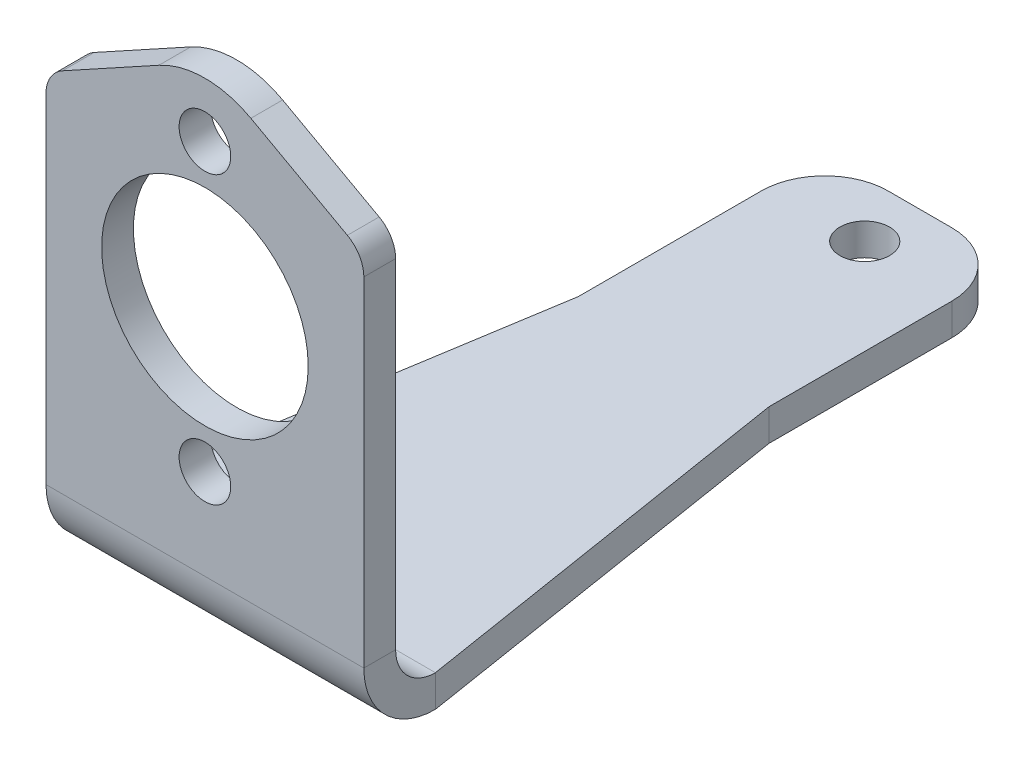
ISO-10303-21;
HEADER;
FILE_DESCRIPTION(('STEP AP214'),'2;1');
FILE_NAME('part.step','',(''),(''),'','','');
FILE_SCHEMA(('AUTOMOTIVE_DESIGN { 1 0 10303 214 1 1 1 1 }'));
ENDSEC;
DATA;
#1=APPLICATION_CONTEXT('core data for automotive mechanical design processes');
#2=APPLICATION_PROTOCOL_DEFINITION('international standard','automotive_design',2000,#1);
#3=PRODUCT_CONTEXT('',#1,'mechanical');
#4=PRODUCT('Part','Part','',(#3));
#5=PRODUCT_RELATED_PRODUCT_CATEGORY('part','',(#4));
#6=PRODUCT_DEFINITION_FORMATION('','',#4);
#7=PRODUCT_DEFINITION_CONTEXT('part definition',#1,'design');
#8=PRODUCT_DEFINITION('design','',#6,#7);
#9=PRODUCT_DEFINITION_SHAPE('','',#8);
#10=(LENGTH_UNIT() NAMED_UNIT(*) SI_UNIT(.MILLI.,.METRE.));
#11=(NAMED_UNIT(*) PLANE_ANGLE_UNIT() SI_UNIT($,.RADIAN.));
#12=(NAMED_UNIT(*) SI_UNIT($,.STERADIAN.) SOLID_ANGLE_UNIT());
#13=UNCERTAINTY_MEASURE_WITH_UNIT(LENGTH_MEASURE(1.E-05),#10,'distance_accuracy_value','');
#14=(GEOMETRIC_REPRESENTATION_CONTEXT(3) GLOBAL_UNCERTAINTY_ASSIGNED_CONTEXT((#13)) GLOBAL_UNIT_ASSIGNED_CONTEXT((#10,
#11,#12)) REPRESENTATION_CONTEXT('',''));
#15=CARTESIAN_POINT('',(0.,0.,0.));
#16=DIRECTION('',(0.,0.,1.));
#17=DIRECTION('',(1.,0.,0.));
#18=AXIS2_PLACEMENT_3D('',#15,#16,#17);
#19=CARTESIAN_POINT('',(0.,0.,-6.35));
#20=DIRECTION('',(-1.,0.,0.));
#21=DIRECTION('',(0.,0.,1.));
#22=AXIS2_PLACEMENT_3D('',#19,#20,#21);
#23=PLANE('',#22);
#24=DIRECTION('',(0.,-1.,0.));
#25=VECTOR('',#24,1.);
#26=CARTESIAN_POINT('',(0.,0.,0.));
#27=LINE('',#26,#25);
#28=CARTESIAN_POINT('',(0.,81.970427746324,0.));
#29=VERTEX_POINT('',#28);
#30=CARTESIAN_POINT('',(0.,14.3002,0.));
#31=VERTEX_POINT('',#30);
#32=EDGE_CURVE('E265',#29,#31,#27,.T.);
#33=ORIENTED_EDGE('',*,*,#32,.F.);
#34=DIRECTION('',(0.,0.,1.));
#35=VECTOR('',#34,1.);
#36=CARTESIAN_POINT('',(0.,81.970427746324,-6.35));
#37=LINE('',#36,#35);
#38=CARTESIAN_POINT('',(0.,81.970427746324,-6.35));
#39=VERTEX_POINT('',#38);
#40=EDGE_CURVE('E316',#29,#39,#37,.F.);
#41=ORIENTED_EDGE('',*,*,#40,.T.);
#42=DIRECTION('',(0.,-1.,0.));
#43=VECTOR('',#42,1.);
#44=CARTESIAN_POINT('',(0.,0.,-6.35));
#45=LINE('',#44,#43);
#46=CARTESIAN_POINT('',(0.,14.3002,-6.35));
#47=VERTEX_POINT('',#46);
#48=EDGE_CURVE('E268',#39,#47,#45,.T.);
#49=ORIENTED_EDGE('',*,*,#48,.T.);
#50=DIRECTION('',(0.,0.,1.));
#51=VECTOR('',#50,1.);
#52=CARTESIAN_POINT('',(0.,14.3002,-6.35));
#53=LINE('',#52,#51);
#54=EDGE_CURVE('E360',#47,#31,#53,.T.);
#55=ORIENTED_EDGE('',*,*,#54,.T.);
#56=EDGE_LOOP('',(#33,#41,#49,#55));
#57=FACE_BOUND('',#56,.T.);
#58=ADVANCED_FACE('F66',(#57),#23,.T.);
#59=CARTESIAN_POINT('',(0.,0.,-6.35));
#60=DIRECTION('',(0.,0.,-1.));
#61=DIRECTION('',(-1.,0.,0.));
#62=AXIS2_PLACEMENT_3D('',#59,#60,#61);
#63=PLANE('',#62);
#64=CARTESIAN_POINT('',(31.75,32.385,-6.35));
#65=DIRECTION('',(0.,0.,1.));
#66=DIRECTION('',(1.,0.,0.));
#67=AXIS2_PLACEMENT_3D('',#64,#65,#66);
#68=CIRCLE('',#67,5.159375);
#69=CARTESIAN_POINT('',(36.909375,32.385,-6.35));
#70=VERTEX_POINT('',#69);
#71=EDGE_CURVE('E261',#70,#70,#68,.T.);
#72=ORIENTED_EDGE('',*,*,#71,.T.);
#73=EDGE_LOOP('',(#72));
#74=FACE_BOUND('',#73,.T.);
#75=CARTESIAN_POINT('',(31.75,89.535,-6.35));
#76=DIRECTION('',(0.,0.,1.));
#77=DIRECTION('',(1.,0.,0.));
#78=AXIS2_PLACEMENT_3D('',#75,#76,#77);
#79=CIRCLE('',#78,5.159375);
#80=CARTESIAN_POINT('',(36.909375,89.535,-6.35));
#81=VERTEX_POINT('',#80);
#82=EDGE_CURVE('E247',#81,#81,#79,.T.);
#83=ORIENTED_EDGE('',*,*,#82,.T.);
#84=EDGE_LOOP('',(#83));
#85=FACE_BOUND('',#84,.T.);
#86=CARTESIAN_POINT('',(31.75,60.96,-6.35));
#87=DIRECTION('',(0.,0.,1.));
#88=DIRECTION('',(1.,0.,0.));
#89=AXIS2_PLACEMENT_3D('',#86,#87,#88);
#90=CIRCLE('',#89,20.6375);
#91=CARTESIAN_POINT('',(52.3875,60.96,-6.35));
#92=VERTEX_POINT('',#91);
#93=EDGE_CURVE('E262',#92,#92,#90,.T.);
#94=ORIENTED_EDGE('',*,*,#93,.T.);
#95=EDGE_LOOP('',(#94));
#96=FACE_BOUND('',#95,.T.);
#97=DIRECTION('',(-0.876215908676647,0.481918749772156,0.));
#98=VECTOR('',#97,1.);
#99=CARTESIAN_POINT('',(31.75,103.1875,-6.35));
#100=LINE('',#99,#98);
#101=CARTESIAN_POINT('',(60.2101840610532,87.5343987664208,-6.35));
#102=VERTEX_POINT('',#101);
#103=CARTESIAN_POINT('',(40.9305521831596,98.1381962992622,-6.35));
#104=VERTEX_POINT('',#103);
#105=EDGE_CURVE('E274',#102,#104,#100,.T.);
#106=ORIENTED_EDGE('',*,*,#105,.F.);
#107=CARTESIAN_POINT('',(57.15,81.970427746324,-6.35));
#108=DIRECTION('',(0.,0.,-1.));
#109=DIRECTION('',(-1.,0.,0.));
#110=AXIS2_PLACEMENT_3D('',#107,#108,#109);
#111=CIRCLE('',#110,6.35);
#112=CARTESIAN_POINT('',(63.5,81.970427746324,-6.35));
#113=VERTEX_POINT('',#112);
#114=EDGE_CURVE('E311',#102,#113,#111,.T.);
#115=ORIENTED_EDGE('',*,*,#114,.T.);
#116=DIRECTION('',(0.,1.,0.));
#117=VECTOR('',#116,1.);
#118=CARTESIAN_POINT('',(63.5,0.,-6.35));
#119=LINE('',#118,#117);
#120=CARTESIAN_POINT('',(63.5,14.3002,-6.35));
#121=VERTEX_POINT('',#120);
#122=EDGE_CURVE('E270',#121,#113,#119,.T.);
#123=ORIENTED_EDGE('',*,*,#122,.F.);
#124=DIRECTION('',(-1.,0.,0.));
#125=VECTOR('',#124,1.);
#126=CARTESIAN_POINT('',(0.,14.3002,-6.35));
#127=LINE('',#126,#125);
#128=EDGE_CURVE('E366',#47,#121,#127,.F.);
#129=ORIENTED_EDGE('',*,*,#128,.F.);
#130=ORIENTED_EDGE('',*,*,#48,.F.);
#131=CARTESIAN_POINT('',(6.35,81.970427746324,-6.35));
#132=DIRECTION('',(0.,0.,-1.));
#133=DIRECTION('',(-1.,0.,0.));
#134=AXIS2_PLACEMENT_3D('',#131,#132,#133);
#135=CIRCLE('',#134,6.35);
#136=CARTESIAN_POINT('',(3.28981593894681,87.5343987664208,-6.35));
#137=VERTEX_POINT('',#136);
#138=EDGE_CURVE('E309',#39,#137,#135,.T.);
#139=ORIENTED_EDGE('',*,*,#138,.T.);
#140=DIRECTION('',(-0.876215908676647,-0.481918749772156,0.));
#141=VECTOR('',#140,1.);
#142=CARTESIAN_POINT('',(0.,85.725,-6.35));
#143=LINE('',#142,#141);
#144=CARTESIAN_POINT('',(22.5694478168404,98.1381962992622,-6.35));
#145=VERTEX_POINT('',#144);
#146=EDGE_CURVE('E275',#145,#137,#143,.T.);
#147=ORIENTED_EDGE('',*,*,#146,.F.);
#148=CARTESIAN_POINT('',(31.75,81.4462832389721,-6.35));
#149=DIRECTION('',(0.,0.,-1.));
#150=DIRECTION('',(-1.,0.,0.));
#151=AXIS2_PLACEMENT_3D('',#148,#149,#150);
#152=CIRCLE('',#151,19.05);
#153=EDGE_CURVE('E297',#145,#104,#152,.T.);
#154=ORIENTED_EDGE('',*,*,#153,.T.);
#155=EDGE_LOOP('',(#106,#115,#123,#129,#130,#139,#147,#154));
#156=FACE_BOUND('',#155,.T.);
#157=ADVANCED_FACE('F389',(#74,#85,#96,#156),#63,.T.);
#158=CARTESIAN_POINT('',(0.,0.,0.));
#159=DIRECTION('',(0.,0.,-1.));
#160=DIRECTION('',(-1.,0.,0.));
#161=AXIS2_PLACEMENT_3D('',#158,#159,#160);
#162=PLANE('',#161);
#163=CARTESIAN_POINT('',(31.75,60.96,0.));
#164=DIRECTION('',(0.,0.,1.));
#165=DIRECTION('',(1.,0.,0.));
#166=AXIS2_PLACEMENT_3D('',#163,#164,#165);
#167=CIRCLE('',#166,20.6375);
#168=CARTESIAN_POINT('',(52.3875,60.96,0.));
#169=VERTEX_POINT('',#168);
#170=EDGE_CURVE('E252',#169,#169,#167,.T.);
#171=ORIENTED_EDGE('',*,*,#170,.F.);
#172=EDGE_LOOP('',(#171));
#173=FACE_BOUND('',#172,.T.);
#174=CARTESIAN_POINT('',(31.75,89.535,0.));
#175=DIRECTION('',(0.,0.,1.));
#176=DIRECTION('',(1.,0.,0.));
#177=AXIS2_PLACEMENT_3D('',#174,#175,#176);
#178=CIRCLE('',#177,5.159375);
#179=CARTESIAN_POINT('',(36.909375,89.535,0.));
#180=VERTEX_POINT('',#179);
#181=EDGE_CURVE('E253',#180,#180,#178,.T.);
#182=ORIENTED_EDGE('',*,*,#181,.F.);
#183=EDGE_LOOP('',(#182));
#184=FACE_BOUND('',#183,.T.);
#185=CARTESIAN_POINT('',(31.75,32.385,0.));
#186=DIRECTION('',(0.,0.,1.));
#187=DIRECTION('',(1.,0.,0.));
#188=AXIS2_PLACEMENT_3D('',#185,#186,#187);
#189=CIRCLE('',#188,5.159375);
#190=CARTESIAN_POINT('',(36.909375,32.385,0.));
#191=VERTEX_POINT('',#190);
#192=EDGE_CURVE('E254',#191,#191,#189,.T.);
#193=ORIENTED_EDGE('',*,*,#192,.F.);
#194=EDGE_LOOP('',(#193));
#195=FACE_BOUND('',#194,.T.);
#196=DIRECTION('',(0.,1.,0.));
#197=VECTOR('',#196,1.);
#198=CARTESIAN_POINT('',(63.5,0.,0.));
#199=LINE('',#198,#197);
#200=CARTESIAN_POINT('',(63.5,14.3002,0.));
#201=VERTEX_POINT('',#200);
#202=CARTESIAN_POINT('',(63.5,81.970427746324,0.));
#203=VERTEX_POINT('',#202);
#204=EDGE_CURVE('E281',#201,#203,#199,.T.);
#205=ORIENTED_EDGE('',*,*,#204,.T.);
#206=CARTESIAN_POINT('',(57.15,81.970427746324,0.));
#207=DIRECTION('',(0.,0.,-1.));
#208=DIRECTION('',(-1.,0.,0.));
#209=AXIS2_PLACEMENT_3D('',#206,#207,#208);
#210=CIRCLE('',#209,6.35);
#211=CARTESIAN_POINT('',(60.2101840610532,87.5343987664208,0.));
#212=VERTEX_POINT('',#211);
#213=EDGE_CURVE('E305',#203,#212,#210,.F.);
#214=ORIENTED_EDGE('',*,*,#213,.T.);
#215=DIRECTION('',(-0.876215908676647,0.481918749772156,0.));
#216=VECTOR('',#215,1.);
#217=CARTESIAN_POINT('',(31.75,103.1875,0.));
#218=LINE('',#217,#216);
#219=CARTESIAN_POINT('',(40.9305521831596,98.1381962992622,0.));
#220=VERTEX_POINT('',#219);
#221=EDGE_CURVE('E284',#212,#220,#218,.T.);
#222=ORIENTED_EDGE('',*,*,#221,.T.);
#223=CARTESIAN_POINT('',(31.75,81.4462832389721,0.));
#224=DIRECTION('',(0.,0.,-1.));
#225=DIRECTION('',(-1.,0.,0.));
#226=AXIS2_PLACEMENT_3D('',#223,#224,#225);
#227=CIRCLE('',#226,19.05);
#228=CARTESIAN_POINT('',(22.5694478168404,98.1381962992622,0.));
#229=VERTEX_POINT('',#228);
#230=EDGE_CURVE('E293',#220,#229,#227,.F.);
#231=ORIENTED_EDGE('',*,*,#230,.T.);
#232=DIRECTION('',(-0.876215908676647,-0.481918749772156,0.));
#233=VECTOR('',#232,1.);
#234=CARTESIAN_POINT('',(0.,85.725,0.));
#235=LINE('',#234,#233);
#236=CARTESIAN_POINT('',(3.28981593894681,87.5343987664208,0.));
#237=VERTEX_POINT('',#236);
#238=EDGE_CURVE('E271',#229,#237,#235,.T.);
#239=ORIENTED_EDGE('',*,*,#238,.T.);
#240=CARTESIAN_POINT('',(6.35,81.970427746324,0.));
#241=DIRECTION('',(0.,0.,-1.));
#242=DIRECTION('',(-1.,0.,0.));
#243=AXIS2_PLACEMENT_3D('',#240,#241,#242);
#244=CIRCLE('',#243,6.35);
#245=EDGE_CURVE('E303',#237,#29,#244,.F.);
#246=ORIENTED_EDGE('',*,*,#245,.T.);
#247=ORIENTED_EDGE('',*,*,#32,.T.);
#248=DIRECTION('',(-1.,0.,0.));
#249=VECTOR('',#248,1.);
#250=CARTESIAN_POINT('',(0.,14.3002,0.));
#251=LINE('',#250,#249);
#252=EDGE_CURVE('E354',#31,#201,#251,.F.);
#253=ORIENTED_EDGE('',*,*,#252,.T.);
#254=EDGE_LOOP('',(#205,#214,#222,#231,#239,#246,#247,#253));
#255=FACE_BOUND('',#254,.T.);
#256=ADVANCED_FACE('F385',(#173,#184,#195,#255),#162,.F.);
#257=CARTESIAN_POINT('',(0.,85.725,-6.35));
#258=DIRECTION('',(-0.481918749772156,0.876215908676647,0.));
#259=DIRECTION('',(-0.876215908676647,-0.481918749772156,0.));
#260=AXIS2_PLACEMENT_3D('',#257,#258,#259);
#261=PLANE('',#260);
#262=ORIENTED_EDGE('',*,*,#146,.T.);
#263=DIRECTION('',(0.,0.,1.));
#264=VECTOR('',#263,1.);
#265=CARTESIAN_POINT('',(3.28981593894681,87.5343987664208,-6.35));
#266=LINE('',#265,#264);
#267=EDGE_CURVE('E313',#137,#237,#266,.T.);
#268=ORIENTED_EDGE('',*,*,#267,.T.);
#269=ORIENTED_EDGE('',*,*,#238,.F.);
#270=DIRECTION('',(0.,0.,1.));
#271=VECTOR('',#270,1.);
#272=CARTESIAN_POINT('',(22.5694478168404,98.1381962992622,-6.35));
#273=LINE('',#272,#271);
#274=EDGE_CURVE('E295',#229,#145,#273,.F.);
#275=ORIENTED_EDGE('',*,*,#274,.T.);
#276=EDGE_LOOP('',(#262,#268,#269,#275));
#277=FACE_BOUND('',#276,.T.);
#278=ADVANCED_FACE('F388',(#277),#261,.T.);
#279=CARTESIAN_POINT('',(31.75,103.1875,-6.35));
#280=DIRECTION('',(0.481918749772156,0.876215908676647,0.));
#281=DIRECTION('',(-0.876215908676647,0.481918749772156,0.));
#282=AXIS2_PLACEMENT_3D('',#279,#280,#281);
#283=PLANE('',#282);
#284=ORIENTED_EDGE('',*,*,#221,.F.);
#285=DIRECTION('',(0.,0.,1.));
#286=VECTOR('',#285,1.);
#287=CARTESIAN_POINT('',(60.2101840610532,87.5343987664208,-6.35));
#288=LINE('',#287,#286);
#289=EDGE_CURVE('E307',#212,#102,#288,.F.);
#290=ORIENTED_EDGE('',*,*,#289,.T.);
#291=ORIENTED_EDGE('',*,*,#105,.T.);
#292=DIRECTION('',(0.,0.,1.));
#293=VECTOR('',#292,1.);
#294=CARTESIAN_POINT('',(40.9305521831596,98.1381962992622,-6.35));
#295=LINE('',#294,#293);
#296=EDGE_CURVE('E290',#104,#220,#295,.T.);
#297=ORIENTED_EDGE('',*,*,#296,.T.);
#298=EDGE_LOOP('',(#284,#290,#291,#297));
#299=FACE_BOUND('',#298,.T.);
#300=ADVANCED_FACE('F439',(#299),#283,.T.);
#301=CARTESIAN_POINT('',(63.5,0.,-6.35));
#302=DIRECTION('',(1.,0.,0.));
#303=DIRECTION('',(0.,0.,-1.));
#304=AXIS2_PLACEMENT_3D('',#301,#302,#303);
#305=PLANE('',#304);
#306=ORIENTED_EDGE('',*,*,#122,.T.);
#307=DIRECTION('',(0.,0.,1.));
#308=VECTOR('',#307,1.);
#309=CARTESIAN_POINT('',(63.5,81.970427746324,-6.35));
#310=LINE('',#309,#308);
#311=EDGE_CURVE('E300',#113,#203,#310,.T.);
#312=ORIENTED_EDGE('',*,*,#311,.T.);
#313=ORIENTED_EDGE('',*,*,#204,.F.);
#314=DIRECTION('',(0.,0.,1.));
#315=VECTOR('',#314,1.);
#316=CARTESIAN_POINT('',(63.5,14.3002,-6.35));
#317=LINE('',#316,#315);
#318=EDGE_CURVE('E371',#121,#201,#317,.T.);
#319=ORIENTED_EDGE('',*,*,#318,.F.);
#320=EDGE_LOOP('',(#306,#312,#313,#319));
#321=FACE_BOUND('',#320,.T.);
#322=ADVANCED_FACE('F396',(#321),#305,.T.);
#323=CARTESIAN_POINT('',(31.75,60.96,-6.35));
#324=DIRECTION('',(0.,0.,1.));
#325=DIRECTION('',(1.,0.,0.));
#326=AXIS2_PLACEMENT_3D('',#323,#324,#325);
#327=CYLINDRICAL_SURFACE('',#326,20.6375);
#328=ORIENTED_EDGE('',*,*,#93,.F.);
#329=EDGE_LOOP('',(#328));
#330=FACE_BOUND('',#329,.T.);
#331=ORIENTED_EDGE('',*,*,#170,.T.);
#332=EDGE_LOOP('',(#331));
#333=FACE_BOUND('',#332,.T.);
#334=ADVANCED_FACE('F446',(#330,#333),#327,.F.);
#335=CARTESIAN_POINT('',(31.75,89.535,-6.35));
#336=DIRECTION('',(0.,0.,1.));
#337=DIRECTION('',(1.,0.,0.));
#338=AXIS2_PLACEMENT_3D('',#335,#336,#337);
#339=CYLINDRICAL_SURFACE('',#338,5.159375);
#340=ORIENTED_EDGE('',*,*,#82,.F.);
#341=EDGE_LOOP('',(#340));
#342=FACE_BOUND('',#341,.T.);
#343=ORIENTED_EDGE('',*,*,#181,.T.);
#344=EDGE_LOOP('',(#343));
#345=FACE_BOUND('',#344,.T.);
#346=ADVANCED_FACE('F509',(#342,#345),#339,.F.);
#347=CARTESIAN_POINT('',(31.75,32.385,-6.35));
#348=DIRECTION('',(0.,0.,1.));
#349=DIRECTION('',(1.,0.,0.));
#350=AXIS2_PLACEMENT_3D('',#347,#348,#349);
#351=CYLINDRICAL_SURFACE('',#350,5.159375);
#352=ORIENTED_EDGE('',*,*,#71,.F.);
#353=EDGE_LOOP('',(#352));
#354=FACE_BOUND('',#353,.T.);
#355=ORIENTED_EDGE('',*,*,#192,.T.);
#356=EDGE_LOOP('',(#355));
#357=FACE_BOUND('',#356,.T.);
#358=ADVANCED_FACE('F383',(#354,#357),#351,.F.);
#359=CARTESIAN_POINT('',(63.5,14.3002,-14.3002));
#360=DIRECTION('',(1.,0.,0.));
#361=DIRECTION('',(0.,0.,-1.));
#362=AXIS2_PLACEMENT_3D('',#359,#360,#361);
#363=PLANE('',#362);
#364=DIRECTION('',(0.,1.,0.));
#365=VECTOR('',#364,1.);
#366=CARTESIAN_POINT('',(63.5,0.,-14.3002));
#367=LINE('',#366,#365);
#368=CARTESIAN_POINT('',(63.5,6.34999999999974,-14.3002));
#369=VERTEX_POINT('',#368);
#370=CARTESIAN_POINT('',(63.5,0.,-14.3002));
#371=VERTEX_POINT('',#370);
#372=EDGE_CURVE('E215',#369,#371,#367,.F.);
#373=ORIENTED_EDGE('',*,*,#372,.F.);
#374=CARTESIAN_POINT('',(63.5,14.3002,-14.3002));
#375=DIRECTION('',(-1.,0.,0.));
#376=DIRECTION('',(0.,0.,1.));
#377=AXIS2_PLACEMENT_3D('',#374,#375,#376);
#378=CIRCLE('',#377,7.9502);
#379=EDGE_CURVE('E363',#121,#369,#378,.F.);
#380=ORIENTED_EDGE('',*,*,#379,.F.);
#381=ORIENTED_EDGE('',*,*,#318,.T.);
#382=CARTESIAN_POINT('',(63.5,14.3002,-14.3002));
#383=DIRECTION('',(-1.,0.,0.));
#384=DIRECTION('',(0.,0.,1.));
#385=AXIS2_PLACEMENT_3D('',#382,#383,#384);
#386=CIRCLE('',#385,14.3002);
#387=EDGE_CURVE('E356',#201,#371,#386,.F.);
#388=ORIENTED_EDGE('',*,*,#387,.T.);
#389=EDGE_LOOP('',(#373,#380,#381,#388));
#390=FACE_BOUND('',#389,.T.);
#391=ADVANCED_FACE('F403',(#390),#363,.T.);
#392=CARTESIAN_POINT('',(0.,14.3002,-14.3002));
#393=DIRECTION('',(1.,0.,0.));
#394=DIRECTION('',(0.,0.,-1.));
#395=AXIS2_PLACEMENT_3D('',#392,#393,#394);
#396=PLANE('',#395);
#397=CARTESIAN_POINT('',(0.,14.3002,-14.3002));
#398=DIRECTION('',(-1.,0.,0.));
#399=DIRECTION('',(0.,0.,1.));
#400=AXIS2_PLACEMENT_3D('',#397,#398,#399);
#401=CIRCLE('',#400,7.9502);
#402=CARTESIAN_POINT('',(0.,6.34999999999983,-14.3002));
#403=VERTEX_POINT('',#402);
#404=EDGE_CURVE('E337',#403,#47,#401,.T.);
#405=ORIENTED_EDGE('',*,*,#404,.F.);
#406=DIRECTION('',(0.,1.,0.));
#407=VECTOR('',#406,1.);
#408=CARTESIAN_POINT('',(0.,6.34999999999997,-14.3002));
#409=LINE('',#408,#407);
#410=CARTESIAN_POINT('',(0.,0.,-14.3002));
#411=VERTEX_POINT('',#410);
#412=EDGE_CURVE('E345',#403,#411,#409,.F.);
#413=ORIENTED_EDGE('',*,*,#412,.T.);
#414=CARTESIAN_POINT('',(0.,14.3002,-14.3002));
#415=DIRECTION('',(-1.,0.,0.));
#416=DIRECTION('',(0.,0.,1.));
#417=AXIS2_PLACEMENT_3D('',#414,#415,#416);
#418=CIRCLE('',#417,14.3002);
#419=EDGE_CURVE('E357',#411,#31,#418,.T.);
#420=ORIENTED_EDGE('',*,*,#419,.T.);
#421=ORIENTED_EDGE('',*,*,#54,.F.);
#422=EDGE_LOOP('',(#405,#413,#420,#421));
#423=FACE_BOUND('',#422,.T.);
#424=ADVANCED_FACE('F409',(#423),#396,.F.);
#425=CARTESIAN_POINT('',(0.,14.3002,-14.3002));
#426=DIRECTION('',(-1.,0.,0.));
#427=DIRECTION('',(0.,-1.,0.));
#428=AXIS2_PLACEMENT_3D('',#425,#426,#427);
#429=CYLINDRICAL_SURFACE('',#428,14.3002);
#430=ORIENTED_EDGE('',*,*,#252,.F.);
#431=ORIENTED_EDGE('',*,*,#419,.F.);
#432=DIRECTION('',(-1.,0.,0.));
#433=VECTOR('',#432,1.);
#434=CARTESIAN_POINT('',(63.5,0.,-14.3002));
#435=LINE('',#434,#433);
#436=EDGE_CURVE('E199',#411,#371,#435,.F.);
#437=ORIENTED_EDGE('',*,*,#436,.T.);
#438=ORIENTED_EDGE('',*,*,#387,.F.);
#439=EDGE_LOOP('',(#430,#431,#437,#438));
#440=FACE_BOUND('',#439,.T.);
#441=ADVANCED_FACE('F405',(#440),#429,.T.);
#442=CARTESIAN_POINT('',(0.,14.3002,-14.3002));
#443=DIRECTION('',(-1.,0.,0.));
#444=DIRECTION('',(0.,-1.,0.));
#445=AXIS2_PLACEMENT_3D('',#442,#443,#444);
#446=CYLINDRICAL_SURFACE('',#445,7.9502);
#447=ORIENTED_EDGE('',*,*,#128,.T.);
#448=ORIENTED_EDGE('',*,*,#379,.T.);
#449=DIRECTION('',(-1.,0.,0.));
#450=VECTOR('',#449,1.);
#451=CARTESIAN_POINT('',(63.5,6.34999999999997,-14.3002));
#452=LINE('',#451,#450);
#453=EDGE_CURVE('E350',#369,#403,#452,.T.);
#454=ORIENTED_EDGE('',*,*,#453,.T.);
#455=ORIENTED_EDGE('',*,*,#404,.T.);
#456=EDGE_LOOP('',(#447,#448,#454,#455));
#457=FACE_BOUND('',#456,.T.);
#458=ADVANCED_FACE('F413',(#457),#446,.F.);
#459=CARTESIAN_POINT('',(0.,0.,0.));
#460=DIRECTION('',(0.,1.,0.));
#461=DIRECTION('',(0.,0.,1.));
#462=AXIS2_PLACEMENT_3D('',#459,#460,#461);
#463=PLANE('',#462);
#464=CARTESIAN_POINT('',(31.75,-5.81999726190219E-13,-30.2259999999997));
#465=DIRECTION('',(0.,1.,0.));
#466=DIRECTION('',(0.,0.,1.));
#467=AXIS2_PLACEMENT_3D('',#464,#465,#466);
#468=CIRCLE('',#467,4.9609375);
#469=CARTESIAN_POINT('',(31.75,-5.64678705485802E-13,-25.2650624999997));
#470=VERTEX_POINT('',#469);
#471=EDGE_CURVE('E212',#470,#470,#468,.T.);
#472=ORIENTED_EDGE('',*,*,#471,.T.);
#473=EDGE_LOOP('',(#472));
#474=FACE_BOUND('',#473,.T.);
#475=CARTESIAN_POINT('',(31.75,-9.36750677027476E-13,-131.826));
#476=DIRECTION('',(0.,1.,0.));
#477=DIRECTION('',(0.,0.,1.));
#478=AXIS2_PLACEMENT_3D('',#475,#476,#477);
#479=CIRCLE('',#478,4.9609375);
#480=CARTESIAN_POINT('',(31.75,-9.19429656323059E-13,-126.8650625));
#481=VERTEX_POINT('',#480);
#482=EDGE_CURVE('E220',#481,#481,#479,.T.);
#483=ORIENTED_EDGE('',*,*,#482,.T.);
#484=EDGE_LOOP('',(#483));
#485=FACE_BOUND('',#484,.T.);
#486=DIRECTION('',(0.,0.,1.));
#487=VECTOR('',#486,1.);
#488=CARTESIAN_POINT('',(12.7,-3.27065212712398E-13,-93.6752));
#489=LINE('',#488,#487);
#490=CARTESIAN_POINT('',(12.7,-4.54503583283905E-13,-130.175));
#491=VERTEX_POINT('',#490);
#492=CARTESIAN_POINT('',(12.7,-3.27065212712398E-13,-93.6752));
#493=VERTEX_POINT('',#492);
#494=EDGE_CURVE('E178',#491,#493,#489,.T.);
#495=ORIENTED_EDGE('',*,*,#494,.F.);
#496=CARTESIAN_POINT('',(25.4,-4.31952178096206E-13,-130.175));
#497=DIRECTION('',(0.,1.,0.));
#498=DIRECTION('',(0.,0.,1.));
#499=AXIS2_PLACEMENT_3D('',#496,#497,#498);
#500=CIRCLE('',#499,12.7);
#501=CARTESIAN_POINT('',(25.4,-4.76293991099514E-13,-142.875));
#502=VERTEX_POINT('',#501);
#503=EDGE_CURVE('E74',#491,#502,#500,.F.);
#504=ORIENTED_EDGE('',*,*,#503,.T.);
#505=DIRECTION('',(1.,0.,0.));
#506=VECTOR('',#505,1.);
#507=CARTESIAN_POINT('',(0.,-4.76293991099514E-13,-142.875));
#508=LINE('',#507,#506);
#509=CARTESIAN_POINT('',(38.1,-4.76293991099514E-13,-142.875));
#510=VERTEX_POINT('',#509);
#511=EDGE_CURVE('E239',#502,#510,#508,.T.);
#512=ORIENTED_EDGE('',*,*,#511,.T.);
#513=CARTESIAN_POINT('',(38.1,-4.31952178096206E-13,-130.175));
#514=DIRECTION('',(0.,1.,0.));
#515=DIRECTION('',(0.,0.,1.));
#516=AXIS2_PLACEMENT_3D('',#513,#514,#515);
#517=CIRCLE('',#516,12.7);
#518=CARTESIAN_POINT('',(50.8,-4.54503583283905E-13,-130.175));
#519=VERTEX_POINT('',#518);
#520=EDGE_CURVE('E81',#510,#519,#517,.F.);
#521=ORIENTED_EDGE('',*,*,#520,.T.);
#522=DIRECTION('',(0.,0.,-1.));
#523=VECTOR('',#522,1.);
#524=CARTESIAN_POINT('',(50.8,-4.98845396287213E-13,-142.875));
#525=LINE('',#524,#523);
#526=CARTESIAN_POINT('',(50.8,-3.27065212712398E-13,-93.6752));
#527=VERTEX_POINT('',#526);
#528=EDGE_CURVE('E205',#527,#519,#525,.T.);
#529=ORIENTED_EDGE('',*,*,#528,.F.);
#530=DIRECTION('',(-0.157990501106673,0.,-0.987440631916705));
#531=VECTOR('',#530,1.);
#532=CARTESIAN_POINT('',(50.8,-3.27065212712398E-13,-93.6752));
#533=LINE('',#532,#531);
#534=EDGE_CURVE('E202',#371,#527,#533,.T.);
#535=ORIENTED_EDGE('',*,*,#534,.F.);
#536=ORIENTED_EDGE('',*,*,#436,.F.);
#537=DIRECTION('',(-0.157990501106673,0.,0.987440631916706));
#538=VECTOR('',#537,1.);
#539=CARTESIAN_POINT('',(0.,0.,-14.3002));
#540=LINE('',#539,#538);
#541=EDGE_CURVE('E185',#493,#411,#540,.T.);
#542=ORIENTED_EDGE('',*,*,#541,.F.);
#543=EDGE_LOOP('',(#495,#504,#512,#521,#529,#535,#536,#542));
#544=FACE_BOUND('',#543,.T.);
#545=ADVANCED_FACE('F196',(#474,#485,#544),#463,.F.);
#546=CARTESIAN_POINT('',(0.,6.35000000000002,0.));
#547=DIRECTION('',(0.,1.,0.));
#548=DIRECTION('',(0.,0.,1.));
#549=AXIS2_PLACEMENT_3D('',#546,#547,#548);
#550=PLANE('',#549);
#551=DIRECTION('',(-1.,0.,0.));
#552=VECTOR('',#551,1.);
#553=CARTESIAN_POINT('',(63.5,6.34999999999952,-142.875));
#554=LINE('',#553,#552);
#555=CARTESIAN_POINT('',(25.4,6.34999999999952,-142.875));
#556=VERTEX_POINT('',#555);
#557=CARTESIAN_POINT('',(38.1,6.34999999999952,-142.875));
#558=VERTEX_POINT('',#557);
#559=EDGE_CURVE('E338',#556,#558,#554,.F.);
#560=ORIENTED_EDGE('',*,*,#559,.F.);
#561=CARTESIAN_POINT('',(25.4,6.34999999999957,-130.175));
#562=DIRECTION('',(0.,1.,0.));
#563=DIRECTION('',(0.,0.,1.));
#564=AXIS2_PLACEMENT_3D('',#561,#562,#563);
#565=CIRCLE('',#564,12.7);
#566=CARTESIAN_POINT('',(12.7,6.34999999999957,-130.175));
#567=VERTEX_POINT('',#566);
#568=EDGE_CURVE('E326',#556,#567,#565,.T.);
#569=ORIENTED_EDGE('',*,*,#568,.T.);
#570=DIRECTION('',(0.,0.,-1.));
#571=VECTOR('',#570,1.);
#572=CARTESIAN_POINT('',(12.7,6.35000000000002,0.));
#573=LINE('',#572,#571);
#574=CARTESIAN_POINT('',(12.7,6.34999999999961,-93.6752));
#575=VERTEX_POINT('',#574);
#576=EDGE_CURVE('E209',#575,#567,#573,.T.);
#577=ORIENTED_EDGE('',*,*,#576,.F.);
#578=DIRECTION('',(0.157990501106673,0.,-0.987440631916706));
#579=VECTOR('',#578,1.);
#580=CARTESIAN_POINT('',(-2.23092043681748,6.35000000000002,-0.356947269890796));
#581=LINE('',#580,#579);
#582=EDGE_CURVE('E192',#403,#575,#581,.T.);
#583=ORIENTED_EDGE('',*,*,#582,.F.);
#584=ORIENTED_EDGE('',*,*,#453,.F.);
#585=DIRECTION('',(0.157990501106673,0.,0.987440631916706));
#586=VECTOR('',#585,1.);
#587=CARTESIAN_POINT('',(64.1458970358814,6.34999999999999,-10.263343525741));
#588=LINE('',#587,#586);
#589=CARTESIAN_POINT('',(50.8,6.34999999999961,-93.6752));
#590=VERTEX_POINT('',#589);
#591=EDGE_CURVE('E279',#590,#369,#588,.T.);
#592=ORIENTED_EDGE('',*,*,#591,.F.);
#593=DIRECTION('',(0.,0.,1.));
#594=VECTOR('',#593,1.);
#595=CARTESIAN_POINT('',(50.8,6.35000000000002,0.));
#596=LINE('',#595,#594);
#597=CARTESIAN_POINT('',(50.8,6.34999999999957,-130.175));
#598=VERTEX_POINT('',#597);
#599=EDGE_CURVE('E193',#598,#590,#596,.T.);
#600=ORIENTED_EDGE('',*,*,#599,.F.);
#601=CARTESIAN_POINT('',(38.1,6.34999999999957,-130.175));
#602=DIRECTION('',(0.,1.,0.));
#603=DIRECTION('',(0.,0.,1.));
#604=AXIS2_PLACEMENT_3D('',#601,#602,#603);
#605=CIRCLE('',#604,12.7);
#606=EDGE_CURVE('E324',#598,#558,#605,.T.);
#607=ORIENTED_EDGE('',*,*,#606,.T.);
#608=EDGE_LOOP('',(#560,#569,#577,#583,#584,#592,#600,#607));
#609=FACE_BOUND('',#608,.T.);
#610=CARTESIAN_POINT('',(31.75,6.34999999999992,-30.2259999999997));
#611=DIRECTION('',(0.,1.,0.));
#612=DIRECTION('',(0.,0.,1.));
#613=AXIS2_PLACEMENT_3D('',#610,#611,#612);
#614=CIRCLE('',#613,4.9609375);
#615=CARTESIAN_POINT('',(31.75,6.34999999999993,-25.2650624999997));
#616=VERTEX_POINT('',#615);
#617=EDGE_CURVE('E216',#616,#616,#614,.T.);
#618=ORIENTED_EDGE('',*,*,#617,.F.);
#619=EDGE_LOOP('',(#618));
#620=FACE_BOUND('',#619,.T.);
#621=CARTESIAN_POINT('',(31.75,6.34999999999956,-131.826));
#622=DIRECTION('',(0.,1.,0.));
#623=DIRECTION('',(0.,0.,1.));
#624=AXIS2_PLACEMENT_3D('',#621,#622,#623);
#625=CIRCLE('',#624,4.9609375);
#626=CARTESIAN_POINT('',(31.75,6.34999999999958,-126.8650625));
#627=VERTEX_POINT('',#626);
#628=EDGE_CURVE('E211',#627,#627,#625,.T.);
#629=ORIENTED_EDGE('',*,*,#628,.F.);
#630=EDGE_LOOP('',(#629));
#631=FACE_BOUND('',#630,.T.);
#632=ADVANCED_FACE('F341',(#609,#620,#631),#550,.T.);
#633=CARTESIAN_POINT('',(63.5,-4.77048955893622E-13,-142.875));
#634=DIRECTION('',(0.,0.,1.));
#635=DIRECTION('',(0.,-1.,0.));
#636=AXIS2_PLACEMENT_3D('',#633,#634,#635);
#637=PLANE('',#636);
#638=ORIENTED_EDGE('',*,*,#511,.F.);
#639=DIRECTION('',(0.,1.,0.));
#640=VECTOR('',#639,1.);
#641=CARTESIAN_POINT('',(25.4,-4.77048955893622E-13,-142.875));
#642=LINE('',#641,#640);
#643=EDGE_CURVE('E321',#502,#556,#642,.T.);
#644=ORIENTED_EDGE('',*,*,#643,.T.);
#645=ORIENTED_EDGE('',*,*,#559,.T.);
#646=DIRECTION('',(0.,-1.,0.));
#647=VECTOR('',#646,1.);
#648=CARTESIAN_POINT('',(38.1,-4.77048955893622E-13,-142.875));
#649=LINE('',#648,#647);
#650=EDGE_CURVE('E318',#558,#510,#649,.T.);
#651=ORIENTED_EDGE('',*,*,#650,.T.);
#652=EDGE_LOOP('',(#638,#644,#645,#651));
#653=FACE_BOUND('',#652,.T.);
#654=ADVANCED_FACE('F333',(#653),#637,.F.);
#655=CARTESIAN_POINT('',(31.75,-9.36750677027476E-13,-131.826));
#656=DIRECTION('',(0.,1.,0.));
#657=DIRECTION('',(0.,0.,1.));
#658=AXIS2_PLACEMENT_3D('',#655,#656,#657);
#659=CYLINDRICAL_SURFACE('',#658,4.9609375);
#660=ORIENTED_EDGE('',*,*,#482,.F.);
#661=EDGE_LOOP('',(#660));
#662=FACE_BOUND('',#661,.T.);
#663=ORIENTED_EDGE('',*,*,#628,.T.);
#664=EDGE_LOOP('',(#663));
#665=FACE_BOUND('',#664,.T.);
#666=ADVANCED_FACE('F485',(#662,#665),#659,.F.);
#667=CARTESIAN_POINT('',(31.75,-5.81999726190219E-13,-30.2259999999997));
#668=DIRECTION('',(0.,1.,0.));
#669=DIRECTION('',(0.,0.,1.));
#670=AXIS2_PLACEMENT_3D('',#667,#668,#669);
#671=CYLINDRICAL_SURFACE('',#670,4.9609375);
#672=ORIENTED_EDGE('',*,*,#471,.F.);
#673=EDGE_LOOP('',(#672));
#674=FACE_BOUND('',#673,.T.);
#675=ORIENTED_EDGE('',*,*,#617,.T.);
#676=EDGE_LOOP('',(#675));
#677=FACE_BOUND('',#676,.T.);
#678=ADVANCED_FACE('F476',(#674,#677),#671,.F.);
#679=CARTESIAN_POINT('',(50.8,103.1875,-93.6752000000004));
#680=DIRECTION('',(-0.987440631916705,0.,0.157990501106673));
#681=DIRECTION('',(0.157990501106673,0.,0.987440631916706));
#682=AXIS2_PLACEMENT_3D('',#679,#680,#681);
#683=PLANE('',#682);
#684=ORIENTED_EDGE('',*,*,#591,.T.);
#685=ORIENTED_EDGE('',*,*,#372,.T.);
#686=ORIENTED_EDGE('',*,*,#534,.T.);
#687=DIRECTION('',(0.,-1.,0.));
#688=VECTOR('',#687,1.);
#689=CARTESIAN_POINT('',(50.8,103.1875,-93.6752000000004));
#690=LINE('',#689,#688);
#691=EDGE_CURVE('E186',#590,#527,#690,.T.);
#692=ORIENTED_EDGE('',*,*,#691,.F.);
#693=EDGE_LOOP('',(#684,#685,#686,#692));
#694=FACE_BOUND('',#693,.T.);
#695=ADVANCED_FACE('F474',(#694),#683,.F.);
#696=CARTESIAN_POINT('',(50.8,103.1875,-142.875));
#697=DIRECTION('',(-1.,0.,0.));
#698=DIRECTION('',(0.,0.,1.));
#699=AXIS2_PLACEMENT_3D('',#696,#697,#698);
#700=PLANE('',#699);
#701=ORIENTED_EDGE('',*,*,#528,.T.);
#702=DIRECTION('',(0.,-1.,0.));
#703=VECTOR('',#702,1.);
#704=CARTESIAN_POINT('',(50.8,103.1875,-130.175));
#705=LINE('',#704,#703);
#706=EDGE_CURVE('E14',#519,#598,#705,.F.);
#707=ORIENTED_EDGE('',*,*,#706,.T.);
#708=ORIENTED_EDGE('',*,*,#599,.T.);
#709=ORIENTED_EDGE('',*,*,#691,.T.);
#710=EDGE_LOOP('',(#701,#707,#708,#709));
#711=FACE_BOUND('',#710,.T.);
#712=ADVANCED_FACE('F471',(#711),#700,.F.);
#713=CARTESIAN_POINT('',(0.,103.1875,-14.3002000000004));
#714=DIRECTION('',(0.987440631916706,0.,0.157990501106673));
#715=DIRECTION('',(0.157990501106673,0.,-0.987440631916706));
#716=AXIS2_PLACEMENT_3D('',#713,#714,#715);
#717=PLANE('',#716);
#718=ORIENTED_EDGE('',*,*,#582,.T.);
#719=DIRECTION('',(0.,-1.,0.));
#720=VECTOR('',#719,1.);
#721=CARTESIAN_POINT('',(12.7,103.1875,-93.6752000000004));
#722=LINE('',#721,#720);
#723=EDGE_CURVE('E181',#575,#493,#722,.T.);
#724=ORIENTED_EDGE('',*,*,#723,.T.);
#725=ORIENTED_EDGE('',*,*,#541,.T.);
#726=ORIENTED_EDGE('',*,*,#412,.F.);
#727=EDGE_LOOP('',(#718,#724,#725,#726));
#728=FACE_BOUND('',#727,.T.);
#729=ADVANCED_FACE('F189',(#728),#717,.F.);
#730=CARTESIAN_POINT('',(12.7,103.1875,-93.6752000000004));
#731=DIRECTION('',(1.,0.,0.));
#732=DIRECTION('',(0.,0.,-1.));
#733=AXIS2_PLACEMENT_3D('',#730,#731,#732);
#734=PLANE('',#733);
#735=ORIENTED_EDGE('',*,*,#576,.T.);
#736=DIRECTION('',(0.,1.,0.));
#737=VECTOR('',#736,1.);
#738=CARTESIAN_POINT('',(12.7,103.1875,-130.175));
#739=LINE('',#738,#737);
#740=EDGE_CURVE('E89',#567,#491,#739,.F.);
#741=ORIENTED_EDGE('',*,*,#740,.T.);
#742=ORIENTED_EDGE('',*,*,#494,.T.);
#743=ORIENTED_EDGE('',*,*,#723,.F.);
#744=EDGE_LOOP('',(#735,#741,#742,#743));
#745=FACE_BOUND('',#744,.T.);
#746=ADVANCED_FACE('F180',(#745),#734,.F.);
#747=CARTESIAN_POINT('',(31.75,81.4462832389721,-6.35));
#748=DIRECTION('',(0.,0.,1.));
#749=DIRECTION('',(1.,0.,0.));
#750=AXIS2_PLACEMENT_3D('',#747,#748,#749);
#751=CYLINDRICAL_SURFACE('',#750,19.05);
#752=ORIENTED_EDGE('',*,*,#153,.F.);
#753=ORIENTED_EDGE('',*,*,#274,.F.);
#754=ORIENTED_EDGE('',*,*,#230,.F.);
#755=ORIENTED_EDGE('',*,*,#296,.F.);
#756=EDGE_LOOP('',(#752,#753,#754,#755));
#757=FACE_BOUND('',#756,.T.);
#758=ADVANCED_FACE('F432',(#757),#751,.T.);
#759=CARTESIAN_POINT('',(57.15,81.970427746324,-6.35));
#760=DIRECTION('',(0.,0.,1.));
#761=DIRECTION('',(1.,0.,0.));
#762=AXIS2_PLACEMENT_3D('',#759,#760,#761);
#763=CYLINDRICAL_SURFACE('',#762,6.35);
#764=ORIENTED_EDGE('',*,*,#114,.F.);
#765=ORIENTED_EDGE('',*,*,#289,.F.);
#766=ORIENTED_EDGE('',*,*,#213,.F.);
#767=ORIENTED_EDGE('',*,*,#311,.F.);
#768=EDGE_LOOP('',(#764,#765,#766,#767));
#769=FACE_BOUND('',#768,.T.);
#770=ADVANCED_FACE('F438',(#769),#763,.T.);
#771=CARTESIAN_POINT('',(6.35,81.970427746324,-6.35));
#772=DIRECTION('',(0.,0.,1.));
#773=DIRECTION('',(1.,0.,0.));
#774=AXIS2_PLACEMENT_3D('',#771,#772,#773);
#775=CYLINDRICAL_SURFACE('',#774,6.35);
#776=ORIENTED_EDGE('',*,*,#138,.F.);
#777=ORIENTED_EDGE('',*,*,#40,.F.);
#778=ORIENTED_EDGE('',*,*,#245,.F.);
#779=ORIENTED_EDGE('',*,*,#267,.F.);
#780=EDGE_LOOP('',(#776,#777,#778,#779));
#781=FACE_BOUND('',#780,.T.);
#782=ADVANCED_FACE('F423',(#781),#775,.T.);
#783=CARTESIAN_POINT('',(25.4,-4.32707142890314E-13,-130.175));
#784=DIRECTION('',(0.,1.,0.));
#785=DIRECTION('',(0.,0.,1.));
#786=AXIS2_PLACEMENT_3D('',#783,#784,#785);
#787=CYLINDRICAL_SURFACE('',#786,12.7);
#788=ORIENTED_EDGE('',*,*,#503,.F.);
#789=ORIENTED_EDGE('',*,*,#740,.F.);
#790=ORIENTED_EDGE('',*,*,#568,.F.);
#791=ORIENTED_EDGE('',*,*,#643,.F.);
#792=EDGE_LOOP('',(#788,#789,#790,#791));
#793=FACE_BOUND('',#792,.T.);
#794=ADVANCED_FACE('F339',(#793),#787,.T.);
#795=CARTESIAN_POINT('',(38.1,-4.32707142890314E-13,-130.175));
#796=DIRECTION('',(0.,-1.,0.));
#797=DIRECTION('',(0.,0.,-1.));
#798=AXIS2_PLACEMENT_3D('',#795,#796,#797);
#799=CYLINDRICAL_SURFACE('',#798,12.7);
#800=ORIENTED_EDGE('',*,*,#606,.F.);
#801=ORIENTED_EDGE('',*,*,#706,.F.);
#802=ORIENTED_EDGE('',*,*,#520,.F.);
#803=ORIENTED_EDGE('',*,*,#650,.F.);
#804=EDGE_LOOP('',(#800,#801,#802,#803));
#805=FACE_BOUND('',#804,.T.);
#806=ADVANCED_FACE('F68',(#805),#799,.T.);
#807=CLOSED_SHELL('',(#58,#157,#256,#278,#300,#322,#334,#346,#358,#391,#424,#441,#458,#545,#632,
#654,#666,#678,#695,#712,#729,#746,#758,#770,#782,#794,#806));
#808=MANIFOLD_SOLID_BREP('B2',#807);
#809=ADVANCED_BREP_SHAPE_REPRESENTATION('',(#18,#808),#14);
#810=SHAPE_DEFINITION_REPRESENTATION(#9,#809);
ENDSEC;
END-ISO-10303-21;
